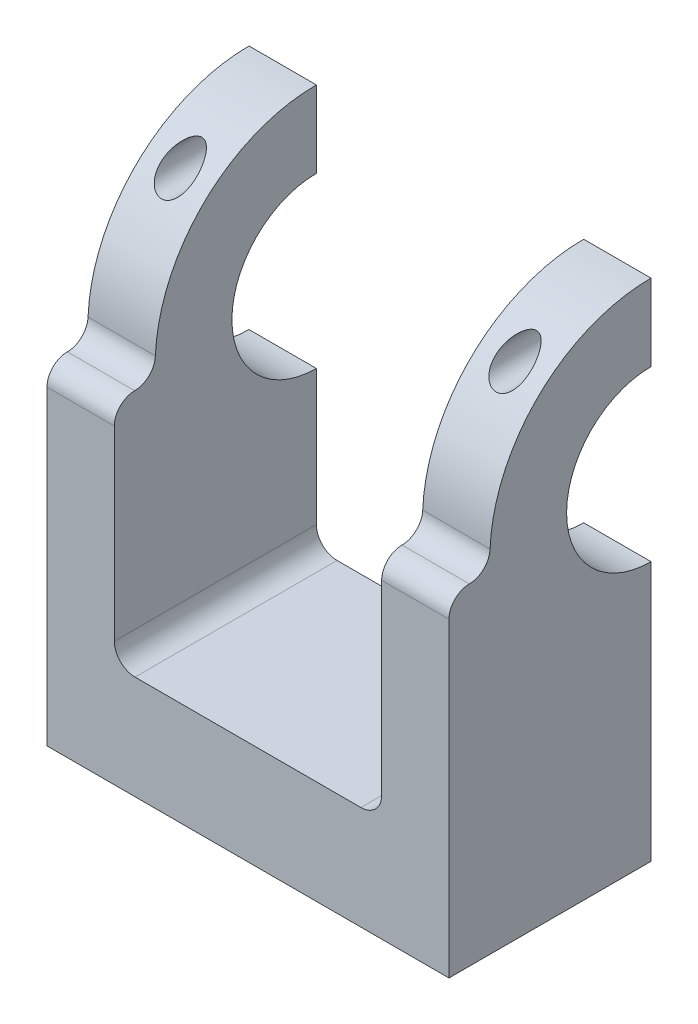
ISO-10303-21;
HEADER;
FILE_DESCRIPTION(('STEP AP214'),'2;1');
FILE_NAME('part.step','',(''),(''),'','','');
FILE_SCHEMA(('AUTOMOTIVE_DESIGN { 1 0 10303 214 1 1 1 1 }'));
ENDSEC;
DATA;
#1=APPLICATION_CONTEXT('core data for automotive mechanical design processes');
#2=APPLICATION_PROTOCOL_DEFINITION('international standard','automotive_design',2000,#1);
#3=PRODUCT_CONTEXT('',#1,'mechanical');
#4=PRODUCT('Part','Part','',(#3));
#5=PRODUCT_RELATED_PRODUCT_CATEGORY('part','',(#4));
#6=PRODUCT_DEFINITION_FORMATION('','',#4);
#7=PRODUCT_DEFINITION_CONTEXT('part definition',#1,'design');
#8=PRODUCT_DEFINITION('design','',#6,#7);
#9=PRODUCT_DEFINITION_SHAPE('','',#8);
#10=(LENGTH_UNIT() NAMED_UNIT(*) SI_UNIT(.MILLI.,.METRE.));
#11=(NAMED_UNIT(*) PLANE_ANGLE_UNIT() SI_UNIT($,.RADIAN.));
#12=(NAMED_UNIT(*) SI_UNIT($,.STERADIAN.) SOLID_ANGLE_UNIT());
#13=UNCERTAINTY_MEASURE_WITH_UNIT(LENGTH_MEASURE(1.E-05),#10,'distance_accuracy_value','');
#14=(GEOMETRIC_REPRESENTATION_CONTEXT(3) GLOBAL_UNCERTAINTY_ASSIGNED_CONTEXT((#13)) GLOBAL_UNIT_ASSIGNED_CONTEXT((#10,
#11,#12)) REPRESENTATION_CONTEXT('',''));
#15=CARTESIAN_POINT('',(0.,0.,0.));
#16=DIRECTION('',(0.,0.,1.));
#17=DIRECTION('',(1.,0.,0.));
#18=AXIS2_PLACEMENT_3D('',#15,#16,#17);
#19=CARTESIAN_POINT('',(38.8,0.,0.));
#20=DIRECTION('',(1.,0.,0.));
#21=DIRECTION('',(0.,0.,-1.));
#22=AXIS2_PLACEMENT_3D('',#19,#20,#21);
#23=PLANE('',#22);
#24=CARTESIAN_POINT('',(38.8,0.754006420562266,17.5337952057662));
#25=DIRECTION('',(1.,0.,0.));
#26=DIRECTION('',(0.,0.,-1.));
#27=AXIS2_PLACEMENT_3D('',#24,#25,#26);
#28=CIRCLE('',#27,2.);
#29=CARTESIAN_POINT('',(38.8,0.668079762948333,15.5356419059638));
#30=VERTEX_POINT('',#29);
#31=CARTESIAN_POINT('',(38.8,-1.24599357943773,17.5337952057662));
#32=VERTEX_POINT('',#31);
#33=EDGE_CURVE('E330',#30,#32,#28,.F.);
#34=ORIENTED_EDGE('',*,*,#33,.T.);
#35=CARTESIAN_POINT('',(38.8,-3.2121983736715,17.5337952057662));
#36=DIRECTION('',(1.,0.,0.));
#37=DIRECTION('',(0.,0.,-1.));
#38=AXIS2_PLACEMENT_3D('',#35,#36,#37);
#39=CIRCLE('',#38,1.96620479423377);
#40=CARTESIAN_POINT('',(38.8,-3.2121983736715,19.5));
#41=VERTEX_POINT('',#40);
#42=EDGE_CURVE('E236',#32,#41,#39,.T.);
#43=ORIENTED_EDGE('',*,*,#42,.T.);
#44=DIRECTION('',(0.,1.,0.));
#45=VECTOR('',#44,1.);
#46=CARTESIAN_POINT('',(38.8,-23.2,19.5));
#47=LINE('',#46,#45);
#48=CARTESIAN_POINT('',(38.8,-33.2,19.5));
#49=VERTEX_POINT('',#48);
#50=EDGE_CURVE('E246',#49,#41,#47,.T.);
#51=ORIENTED_EDGE('',*,*,#50,.F.);
#52=DIRECTION('',(0.,0.,-1.));
#53=VECTOR('',#52,1.);
#54=CARTESIAN_POINT('',(38.8,-33.2,19.5));
#55=LINE('',#54,#53);
#56=CARTESIAN_POINT('',(38.8,-33.2,0.));
#57=VERTEX_POINT('',#56);
#58=EDGE_CURVE('E205',#49,#57,#55,.T.);
#59=ORIENTED_EDGE('',*,*,#58,.T.);
#60=DIRECTION('',(0.,-1.,0.));
#61=VECTOR('',#60,1.);
#62=CARTESIAN_POINT('',(38.8,15.55,0.));
#63=LINE('',#62,#61);
#64=CARTESIAN_POINT('',(38.8,-8.15,0.));
#65=VERTEX_POINT('',#64);
#66=EDGE_CURVE('E455',#65,#57,#63,.T.);
#67=ORIENTED_EDGE('',*,*,#66,.F.);
#68=CARTESIAN_POINT('',(38.8,0.,0.));
#69=DIRECTION('',(1.,0.,0.));
#70=DIRECTION('',(0.,0.,-1.));
#71=AXIS2_PLACEMENT_3D('',#68,#69,#70);
#72=CIRCLE('',#71,8.15);
#73=CARTESIAN_POINT('',(38.8,8.15,0.));
#74=VERTEX_POINT('',#73);
#75=EDGE_CURVE('E445',#74,#65,#72,.T.);
#76=ORIENTED_EDGE('',*,*,#75,.F.);
#77=CARTESIAN_POINT('',(38.8,15.55,0.));
#78=VERTEX_POINT('',#77);
#79=EDGE_CURVE('E268',#78,#74,#63,.T.);
#80=ORIENTED_EDGE('',*,*,#79,.F.);
#81=CARTESIAN_POINT('',(38.8,0.,0.));
#82=DIRECTION('',(1.,0.,0.));
#83=DIRECTION('',(0.,0.,-1.));
#84=AXIS2_PLACEMENT_3D('',#81,#82,#83);
#85=CIRCLE('',#84,15.55);
#86=EDGE_CURVE('E424',#78,#30,#85,.T.);
#87=ORIENTED_EDGE('',*,*,#86,.T.);
#88=EDGE_LOOP('',(#34,#43,#51,#59,#67,#76,#80,#87));
#89=FACE_BOUND('',#88,.T.);
#90=ADVANCED_FACE('F47',(#89),#23,.T.);
#91=CARTESIAN_POINT('',(32.3,0.,0.));
#92=DIRECTION('',(1.,0.,0.));
#93=DIRECTION('',(0.,0.,-1.));
#94=AXIS2_PLACEMENT_3D('',#91,#92,#93);
#95=PLANE('',#94);
#96=DIRECTION('',(0.,1.,0.));
#97=VECTOR('',#96,1.);
#98=CARTESIAN_POINT('',(32.3,0.,0.));
#99=LINE('',#98,#97);
#100=CARTESIAN_POINT('',(32.3,-21.2,0.));
#101=VERTEX_POINT('',#100);
#102=CARTESIAN_POINT('',(32.3,-8.15,0.));
#103=VERTEX_POINT('',#102);
#104=EDGE_CURVE('E305',#101,#103,#99,.T.);
#105=ORIENTED_EDGE('',*,*,#104,.F.);
#106=DIRECTION('',(0.,0.,1.));
#107=VECTOR('',#106,1.);
#108=CARTESIAN_POINT('',(32.3,-21.2,0.));
#109=LINE('',#108,#107);
#110=CARTESIAN_POINT('',(32.3,-21.2,19.5));
#111=VERTEX_POINT('',#110);
#112=EDGE_CURVE('E308',#101,#111,#109,.T.);
#113=ORIENTED_EDGE('',*,*,#112,.T.);
#114=DIRECTION('',(0.,-1.,0.));
#115=VECTOR('',#114,1.);
#116=CARTESIAN_POINT('',(32.3,-1.24599357943773,19.5));
#117=LINE('',#116,#115);
#118=CARTESIAN_POINT('',(32.3,-3.2121983736715,19.5));
#119=VERTEX_POINT('',#118);
#120=EDGE_CURVE('E250',#119,#111,#117,.T.);
#121=ORIENTED_EDGE('',*,*,#120,.F.);
#122=CARTESIAN_POINT('',(32.3,-3.2121983736715,17.5337952057662));
#123=DIRECTION('',(1.,0.,0.));
#124=DIRECTION('',(0.,0.,-1.));
#125=AXIS2_PLACEMENT_3D('',#122,#123,#124);
#126=CIRCLE('',#125,1.96620479423377);
#127=CARTESIAN_POINT('',(32.3,-1.24599357943773,17.5337952057662));
#128=VERTEX_POINT('',#127);
#129=EDGE_CURVE('E243',#128,#119,#126,.T.);
#130=ORIENTED_EDGE('',*,*,#129,.F.);
#131=CARTESIAN_POINT('',(32.3,0.754006420562266,17.5337952057662));
#132=DIRECTION('',(1.,0.,0.));
#133=DIRECTION('',(0.,0.,-1.));
#134=AXIS2_PLACEMENT_3D('',#131,#132,#133);
#135=CIRCLE('',#134,2.);
#136=CARTESIAN_POINT('',(32.3,0.668079762948333,15.5356419059638));
#137=VERTEX_POINT('',#136);
#138=EDGE_CURVE('E324',#128,#137,#135,.T.);
#139=ORIENTED_EDGE('',*,*,#138,.T.);
#140=CARTESIAN_POINT('',(32.3,0.,0.));
#141=DIRECTION('',(1.,0.,0.));
#142=DIRECTION('',(0.,0.,-1.));
#143=AXIS2_PLACEMENT_3D('',#140,#141,#142);
#144=CIRCLE('',#143,15.55);
#145=CARTESIAN_POINT('',(32.3,15.55,0.));
#146=VERTEX_POINT('',#145);
#147=EDGE_CURVE('E441',#146,#137,#144,.T.);
#148=ORIENTED_EDGE('',*,*,#147,.F.);
#149=CARTESIAN_POINT('',(32.3,8.15,0.));
#150=VERTEX_POINT('',#149);
#151=EDGE_CURVE('E314',#150,#146,#99,.T.);
#152=ORIENTED_EDGE('',*,*,#151,.F.);
#153=CARTESIAN_POINT('',(32.3,0.,0.));
#154=DIRECTION('',(1.,0.,0.));
#155=DIRECTION('',(0.,0.,-1.));
#156=AXIS2_PLACEMENT_3D('',#153,#154,#155);
#157=CIRCLE('',#156,8.15);
#158=EDGE_CURVE('E311',#150,#103,#157,.T.);
#159=ORIENTED_EDGE('',*,*,#158,.T.);
#160=EDGE_LOOP('',(#105,#113,#121,#130,#139,#148,#152,#159));
#161=FACE_BOUND('',#160,.T.);
#162=ADVANCED_FACE('F293',(#161),#95,.F.);
#163=CARTESIAN_POINT('',(38.8,0.,0.));
#164=DIRECTION('',(-1.,0.,0.));
#165=DIRECTION('',(0.,0.,1.));
#166=AXIS2_PLACEMENT_3D('',#163,#164,#165);
#167=CYLINDRICAL_SURFACE('',#166,15.55);
#168=CARTESIAN_POINT('',(33.95,11.85,10.0687635785135));
#169=CARTESIAN_POINT('',(33.9500012225253,11.9215644775887,9.98453994667964));
#170=CARTESIAN_POINT('',(33.9547910498182,11.9922101877272,9.89957201127039));
#171=CARTESIAN_POINT('',(33.9733499867502,12.1312407756933,9.72870131097328));
#172=CARTESIAN_POINT('',(33.9871236739622,12.1996244822813,9.64279809148068));
#173=CARTESIAN_POINT('',(34.0233140750604,12.3338052468887,9.47056963300651));
#174=CARTESIAN_POINT('',(34.0457450321097,12.3995978443294,9.38424393124782));
#175=CARTESIAN_POINT('',(34.0991332613934,12.5281055808368,9.21198154484363));
#176=CARTESIAN_POINT('',(34.1300867174588,12.5908220825312,9.12604470354066));
#177=CARTESIAN_POINT('',(34.1900069436964,12.6942901102773,8.98124962825988));
#178=CARTESIAN_POINT('',(34.2167254878202,12.7359310553179,8.92208886192055));
#179=CARTESIAN_POINT('',(34.274587984937,12.8173780400416,8.80468169222602));
#180=CARTESIAN_POINT('',(34.3057309945392,12.8571844684927,8.74643509688247));
#181=CARTESIAN_POINT('',(34.3726604333643,12.9346596782492,8.63144669423295));
#182=CARTESIAN_POINT('',(34.4084350539096,12.9723335570977,8.5747014876113));
#183=CARTESIAN_POINT('',(34.4851123531695,13.0453305599229,8.46323130664284));
#184=CARTESIAN_POINT('',(34.5260120488672,13.0806550331949,8.40850518089474));
#185=CARTESIAN_POINT('',(34.6170934410609,13.1512581905055,8.29768389465131));
#186=CARTESIAN_POINT('',(34.6677568806179,13.1863051621385,8.24183201719599));
#187=CARTESIAN_POINT('',(34.7768488724667,13.2522473548452,8.13537595081262));
#188=CARTESIAN_POINT('',(34.8352727698058,13.2831450426127,8.08476864817691));
#189=CARTESIAN_POINT('',(34.9458826943474,13.3324893280661,8.00305809158511));
#190=CARTESIAN_POINT('',(34.9962031196593,13.3521447558813,7.97018829254928));
#191=CARTESIAN_POINT('',(35.1021792769695,13.3870594549479,7.91140350999026));
#192=CARTESIAN_POINT('',(35.1578241428763,13.4023274353647,7.88547475546777));
#193=CARTESIAN_POINT('',(35.2600996129927,13.4241676161055,7.84822136301359));
#194=CARTESIAN_POINT('',(35.3057320671588,13.4319438811107,7.83489074931042));
#195=CARTESIAN_POINT('',(35.3989311411787,13.443541725528,7.81497421637009));
#196=CARTESIAN_POINT('',(35.4464955680058,13.4473676654792,7.80838086034066));
#197=CARTESIAN_POINT('',(35.5424181008429,13.4507036037353,7.80263326472512));
#198=CARTESIAN_POINT('',(35.5907785165623,13.4501973407013,7.803507053767));
#199=CARTESIAN_POINT('',(35.6865559205709,13.4448852098124,7.81265555415488));
#200=CARTESIAN_POINT('',(35.7339722288589,13.4400763498932,7.82093541574892));
#201=CARTESIAN_POINT('',(35.8349222865249,13.42539506737,7.84611439482155));
#202=CARTESIAN_POINT('',(35.8880200233314,13.4147667479122,7.86429715522654));
#203=CARTESIAN_POINT('',(35.9900914862011,13.3891892002713,7.90776502846268));
#204=CARTESIAN_POINT('',(36.0390572897156,13.3742319044257,7.93306339974242));
#205=CARTESIAN_POINT('',(36.1578002530699,13.3320320561386,8.00386697923484));
#206=CARTESIAN_POINT('',(36.2246178932381,13.3025073269004,8.05292470299542));
#207=CARTESIAN_POINT('',(36.3489973065388,13.2379958538583,8.15854318401952));
#208=CARTESIAN_POINT('',(36.406534539868,13.2029950957667,8.21512313479387));
#209=CARTESIAN_POINT('',(36.5075790648004,13.1331095656052,8.32632931951027));
#210=CARTESIAN_POINT('',(36.551936016245,13.098651215009,8.38046412785407));
#211=CARTESIAN_POINT('',(36.6350936193192,13.0271079051105,8.49124919382796));
#212=CARTESIAN_POINT('',(36.6738901225917,12.9900210153043,8.54790128861973));
#213=CARTESIAN_POINT('',(36.746508193994,12.9135559982794,8.66298764611263));
#214=CARTESIAN_POINT('',(36.7803207870012,12.8741739115093,8.72142490059167));
#215=CARTESIAN_POINT('',(36.8432750878646,12.7934296717941,8.83944427761012));
#216=CARTESIAN_POINT('',(36.8724155660237,12.7520670012688,8.89902669695009));
#217=CARTESIAN_POINT('',(36.9380582918188,12.6490547391351,9.04516559061454));
#218=CARTESIAN_POINT('',(36.9722010663349,12.5864489541005,9.13211519018578));
#219=CARTESIAN_POINT('',(37.0316871561499,12.4579591654763,9.30663807445581));
#220=CARTESIAN_POINT('',(37.0570263793739,12.3920736536249,9.39421162993374));
#221=CARTESIAN_POINT('',(37.098858136265,12.2574366564073,9.56921742403365));
#222=CARTESIAN_POINT('',(37.1153546241774,12.1886864668995,9.65664970836082));
#223=CARTESIAN_POINT('',(37.1391949637156,12.0487304110793,9.83072115259907));
#224=CARTESIAN_POINT('',(37.1465424466346,11.9775255305878,9.91736061362392));
#225=CARTESIAN_POINT('',(37.1529075401639,11.7937552561532,10.1360651812451));
#226=CARTESIAN_POINT('',(37.1452214135325,11.6797571903004,10.2672083792395));
#227=CARTESIAN_POINT('',(37.1034935444119,11.4496341669388,10.5232042193498));
#228=CARTESIAN_POINT('',(37.0695044936598,11.3335139142883,10.6480689070259));
#229=CARTESIAN_POINT('',(36.985581229867,11.1381216417741,10.8516517818667));
#230=CARTESIAN_POINT('',(36.9434727723324,11.0582308110025,10.9329893844243));
#231=CARTESIAN_POINT('',(36.8423946013468,10.9021955349043,11.0885835591425));
#232=CARTESIAN_POINT('',(36.7834463715604,10.8260464601162,11.1628489938134));
#233=CARTESIAN_POINT('',(36.6631412718756,10.6981637341553,11.2852888523119));
#234=CARTESIAN_POINT('',(36.6055397061966,10.6448730703492,11.3355124358871));
#235=CARTESIAN_POINT('',(36.4793377172497,10.5450947253015,11.4283902362239));
#236=CARTESIAN_POINT('',(36.4107514296082,10.4985984458551,11.4710540345972));
#237=CARTESIAN_POINT('',(36.276512471407,10.4227639670271,11.5399583383839));
#238=CARTESIAN_POINT('',(36.2125678626135,10.3918435438933,11.5677733915041));
#239=CARTESIAN_POINT('',(36.0786442984448,10.3381373321087,11.6157960679049));
#240=CARTESIAN_POINT('',(36.0086681305404,10.3153478105424,11.636007182404));
#241=CARTESIAN_POINT('',(35.86392927369,10.2793191333336,11.667848584814));
#242=CARTESIAN_POINT('',(35.7891409936362,10.2661365894411,11.6794280171696));
#243=CARTESIAN_POINT('',(35.6375953652042,10.2505878398313,11.6930775970464));
#244=CARTESIAN_POINT('',(35.5608388858363,10.2482169404581,11.6951518710409));
#245=CARTESIAN_POINT('',(35.4158183642081,10.2541522012073,11.6899472703439));
#246=CARTESIAN_POINT('',(35.3474740125365,10.2614123317948,11.6835847484342));
#247=CARTESIAN_POINT('',(35.2133653772756,10.2843356433097,11.6634116357526));
#248=CARTESIAN_POINT('',(35.1476009996647,10.299998517711,11.649601316671));
#249=CARTESIAN_POINT('',(35.0194867390607,10.339008935751,11.6149934839572));
#250=CARTESIAN_POINT('',(34.9571846335783,10.3624425042391,11.5941176966285));
#251=CARTESIAN_POINT('',(34.8379047596766,10.4157073429141,11.5462904443819));
#252=CARTESIAN_POINT('',(34.7809294253313,10.4455415175479,11.5193362209254));
#253=CARTESIAN_POINT('',(34.6514191983157,10.5232386063068,11.4484792498744));
#254=CARTESIAN_POINT('',(34.58170411812,10.5735535223604,11.4020987430205));
#255=CARTESIAN_POINT('',(34.4542953295906,10.6810626965338,11.301453611262));
#256=CARTESIAN_POINT('',(34.3966261482973,10.7382706235895,11.2471732750879));
#257=CARTESIAN_POINT('',(34.274363905549,10.8782927911854,11.1120534782358));
#258=CARTESIAN_POINT('',(34.2146966989135,10.9629360628724,11.0286674717643));
#259=CARTESIAN_POINT('',(34.1148569327634,11.1356186607368,10.8542911787521));
#260=CARTESIAN_POINT('',(34.0747053549166,11.2236615326445,10.7632928306344));
#261=CARTESIAN_POINT('',(34.0108980870918,11.4023653653201,10.5738324839224));
#262=CARTESIAN_POINT('',(33.9876632207512,11.4930382900552,10.4752434720672));
#263=CARTESIAN_POINT('',(33.9572113742946,11.6729357908181,10.2743985704762));
#264=CARTESIAN_POINT('',(33.9499984994422,11.7621599898313,10.1721417477674));
#265=CARTESIAN_POINT('',(33.95,11.85,10.0687635785135));
#266=B_SPLINE_CURVE_WITH_KNOTS('',3,(#168,#169,#170,#171,#172,#173,#174,#175,#176,#177,#178,
#179,#180,#181,#182,#183,#184,#185,#186,#187,#188,#189,#190,#191,#192,#193,#194,#195,#196,#197,
#198,#199,#200,#201,#202,#203,#204,#205,#206,#207,#208,#209,#210,#211,#212,#213,#214,#215,#216,
#217,#218,#219,#220,#221,#222,#223,#224,#225,#226,#227,#228,#229,#230,#231,#232,#233,#234,#235,
#236,#237,#238,#239,#240,#241,#242,#243,#244,#245,#246,#247,#248,#249,#250,#251,#252,#253,#254,
#255,#256,#257,#258,#259,#260,#261,#262,#263,#264,#265),.UNSPECIFIED.,.T.,.F.,(4,2,2,2,2,2,2,2,
2,2,2,2,2,2,2,2,2,2,2,2,2,2,2,2,2,2,2,2,2,2,2,2,2,2,2,2,2,2,2,2,2,2,2,2,2,2,2,2,4),(0.,
0.33142399845103,0.663017000425858,0.995157889412732,1.3271502949389,1.55838314896632,
1.7895667729943,2.02017217375603,2.25064397020438,2.4996331328989,2.74847361332128,
2.93762121082297,3.12639071140163,3.2703239986346,3.41409823568645,3.55841237915848,
3.70282695804654,3.87324754407706,4.0439878010265,4.30649610172351,4.56968754892157,
4.80338920840379,5.03726432279027,5.27155558920561,5.505908420035,5.84282391438361,
6.17989580524212,6.51681684015815,6.85360410648772,7.37356035831772,7.89247768763019,
8.25595993774942,8.61898052357767,8.89749205746568,9.17564802826523,9.40355835954681,
9.63136392162269,9.86050126895598,10.0895391314865,10.2956275775955,10.5017085062571,
10.7101515603773,10.9186894019522,11.2101370087615,11.50217237803,11.8988709734203,
12.2959951296666,12.702688950354,13.1094869648858),.UNSPECIFIED.);
#267=CARTESIAN_POINT('',(33.95,11.85,10.0687635785135));
#268=VERTEX_POINT('',#267);
#269=EDGE_CURVE('E258',#268,#268,#266,.T.);
#270=ORIENTED_EDGE('',*,*,#269,.T.);
#271=EDGE_LOOP('',(#270));
#272=FACE_BOUND('',#271,.T.);
#273=ORIENTED_EDGE('',*,*,#147,.T.);
#274=DIRECTION('',(-1.,0.,0.));
#275=VECTOR('',#274,1.);
#276=CARTESIAN_POINT('',(38.8,0.668079762948333,15.5356419059638));
#277=LINE('',#276,#275);
#278=EDGE_CURVE('E429',#137,#30,#277,.F.);
#279=ORIENTED_EDGE('',*,*,#278,.T.);
#280=ORIENTED_EDGE('',*,*,#86,.F.);
#281=DIRECTION('',(-1.,0.,0.));
#282=VECTOR('',#281,1.);
#283=CARTESIAN_POINT('',(73.5708570501217,15.55,0.));
#284=LINE('',#283,#282);
#285=EDGE_CURVE('E267',#78,#146,#284,.T.);
#286=ORIENTED_EDGE('',*,*,#285,.T.);
#287=EDGE_LOOP('',(#273,#279,#280,#286));
#288=FACE_BOUND('',#287,.T.);
#289=ADVANCED_FACE('F270',(#272,#288),#167,.T.);
#290=CARTESIAN_POINT('',(38.8,0.,0.));
#291=DIRECTION('',(-1.,0.,0.));
#292=DIRECTION('',(0.,0.,1.));
#293=AXIS2_PLACEMENT_3D('',#290,#291,#292);
#294=CYLINDRICAL_SURFACE('',#293,8.15);
#295=ORIENTED_EDGE('',*,*,#75,.T.);
#296=DIRECTION('',(-1.,0.,0.));
#297=VECTOR('',#296,1.);
#298=CARTESIAN_POINT('',(38.8,-8.15,0.));
#299=LINE('',#298,#297);
#300=EDGE_CURVE('E432',#65,#103,#299,.T.);
#301=ORIENTED_EDGE('',*,*,#300,.T.);
#302=ORIENTED_EDGE('',*,*,#158,.F.);
#303=DIRECTION('',(-1.,0.,0.));
#304=VECTOR('',#303,1.);
#305=CARTESIAN_POINT('',(38.8,8.15,0.));
#306=LINE('',#305,#304);
#307=EDGE_CURVE('E437',#150,#74,#306,.F.);
#308=ORIENTED_EDGE('',*,*,#307,.T.);
#309=EDGE_LOOP('',(#295,#301,#302,#308));
#310=FACE_BOUND('',#309,.T.);
#311=ADVANCED_FACE('F288',(#310),#294,.F.);
#312=CARTESIAN_POINT('',(73.5708570501217,15.55,0.));
#313=DIRECTION('',(0.,0.,-1.));
#314=DIRECTION('',(-1.,0.,0.));
#315=AXIS2_PLACEMENT_3D('',#312,#313,#314);
#316=PLANE('',#315);
#317=CARTESIAN_POINT('',(35.55,11.85,0.));
#318=DIRECTION('',(0.,0.,-1.));
#319=DIRECTION('',(-1.,0.,0.));
#320=AXIS2_PLACEMENT_3D('',#317,#318,#319);
#321=CIRCLE('',#320,1.6);
#322=CARTESIAN_POINT('',(33.95,11.85,0.));
#323=VERTEX_POINT('',#322);
#324=EDGE_CURVE('E254',#323,#323,#321,.T.);
#325=ORIENTED_EDGE('',*,*,#324,.F.);
#326=EDGE_LOOP('',(#325));
#327=FACE_BOUND('',#326,.T.);
#328=ORIENTED_EDGE('',*,*,#151,.T.);
#329=ORIENTED_EDGE('',*,*,#285,.F.);
#330=ORIENTED_EDGE('',*,*,#79,.T.);
#331=ORIENTED_EDGE('',*,*,#307,.F.);
#332=EDGE_LOOP('',(#328,#329,#330,#331));
#333=FACE_BOUND('',#332,.T.);
#334=ADVANCED_FACE('F285',(#327,#333),#316,.T.);
#335=DIRECTION('',(1.,0.,0.));
#336=VECTOR('',#335,1.);
#337=CARTESIAN_POINT('',(-21.9146070008111,-23.2,0.));
#338=LINE('',#337,#336);
#339=CARTESIAN_POINT('',(8.5,-23.2,0.));
#340=VERTEX_POINT('',#339);
#341=CARTESIAN_POINT('',(30.3,-23.2,0.));
#342=VERTEX_POINT('',#341);
#343=EDGE_CURVE('E223',#340,#342,#338,.T.);
#344=ORIENTED_EDGE('',*,*,#343,.T.);
#345=CARTESIAN_POINT('',(30.3,-21.2,0.));
#346=DIRECTION('',(0.,0.,-1.));
#347=DIRECTION('',(-1.,0.,0.));
#348=AXIS2_PLACEMENT_3D('',#345,#346,#347);
#349=CIRCLE('',#348,2.);
#350=EDGE_CURVE('E320',#342,#101,#349,.F.);
#351=ORIENTED_EDGE('',*,*,#350,.T.);
#352=ORIENTED_EDGE('',*,*,#104,.T.);
#353=ORIENTED_EDGE('',*,*,#300,.F.);
#354=ORIENTED_EDGE('',*,*,#66,.T.);
#355=DIRECTION('',(1.,0.,0.));
#356=VECTOR('',#355,1.);
#357=CARTESIAN_POINT('',(-21.9146070008111,-33.2,0.));
#358=LINE('',#357,#356);
#359=CARTESIAN_POINT('',(0.,-33.2,0.));
#360=VERTEX_POINT('',#359);
#361=EDGE_CURVE('E227',#360,#57,#358,.T.);
#362=ORIENTED_EDGE('',*,*,#361,.F.);
#363=DIRECTION('',(0.,-1.,0.));
#364=VECTOR('',#363,1.);
#365=CARTESIAN_POINT('',(0.,-33.2,0.));
#366=LINE('',#365,#364);
#367=CARTESIAN_POINT('',(0.,-8.15,0.));
#368=VERTEX_POINT('',#367);
#369=EDGE_CURVE('E209',#368,#360,#366,.T.);
#370=ORIENTED_EDGE('',*,*,#369,.F.);
#371=DIRECTION('',(-1.,0.,0.));
#372=VECTOR('',#371,1.);
#373=CARTESIAN_POINT('',(6.5,-8.15,0.));
#374=LINE('',#373,#372);
#375=CARTESIAN_POINT('',(6.5,-8.15,0.));
#376=VERTEX_POINT('',#375);
#377=EDGE_CURVE('E186',#376,#368,#374,.T.);
#378=ORIENTED_EDGE('',*,*,#377,.F.);
#379=DIRECTION('',(0.,1.,0.));
#380=VECTOR('',#379,1.);
#381=CARTESIAN_POINT('',(6.5,0.,0.));
#382=LINE('',#381,#380);
#383=CARTESIAN_POINT('',(6.5,-21.2,0.));
#384=VERTEX_POINT('',#383);
#385=EDGE_CURVE('E346',#384,#376,#382,.T.);
#386=ORIENTED_EDGE('',*,*,#385,.F.);
#387=CARTESIAN_POINT('',(8.5,-21.2,0.));
#388=DIRECTION('',(0.,0.,-1.));
#389=DIRECTION('',(-1.,0.,0.));
#390=AXIS2_PLACEMENT_3D('',#387,#388,#389);
#391=CIRCLE('',#390,2.);
#392=EDGE_CURVE('E56',#384,#340,#391,.F.);
#393=ORIENTED_EDGE('',*,*,#392,.T.);
#394=EDGE_LOOP('',(#344,#351,#352,#353,#354,#362,#370,#378,#386,#393));
#395=FACE_BOUND('',#394,.T.);
#396=ADVANCED_FACE('F280',(#395),#316,.T.);
#397=CARTESIAN_POINT('',(35.55,11.85,15.55));
#398=DIRECTION('',(0.,0.,-1.));
#399=DIRECTION('',(-1.,0.,0.));
#400=AXIS2_PLACEMENT_3D('',#397,#398,#399);
#401=CYLINDRICAL_SURFACE('',#400,1.6);
#402=ORIENTED_EDGE('',*,*,#324,.T.);
#403=EDGE_LOOP('',(#402));
#404=FACE_BOUND('',#403,.T.);
#405=ORIENTED_EDGE('',*,*,#269,.F.);
#406=EDGE_LOOP('',(#405));
#407=FACE_BOUND('',#406,.T.);
#408=ADVANCED_FACE('F274',(#404,#407),#401,.F.);
#409=CARTESIAN_POINT('',(0.,0.,19.5));
#410=DIRECTION('',(0.,0.,1.));
#411=DIRECTION('',(1.,0.,0.));
#412=AXIS2_PLACEMENT_3D('',#409,#410,#411);
#413=PLANE('',#412);
#414=DIRECTION('',(1.,0.,0.));
#415=VECTOR('',#414,1.);
#416=CARTESIAN_POINT('',(0.,-3.2121983736715,19.5));
#417=LINE('',#416,#415);
#418=EDGE_CURVE('E240',#119,#41,#417,.T.);
#419=ORIENTED_EDGE('',*,*,#418,.F.);
#420=ORIENTED_EDGE('',*,*,#120,.T.);
#421=CARTESIAN_POINT('',(30.3,-21.2,19.5));
#422=DIRECTION('',(0.,0.,1.));
#423=DIRECTION('',(1.,0.,0.));
#424=AXIS2_PLACEMENT_3D('',#421,#422,#423);
#425=CIRCLE('',#424,2.);
#426=CARTESIAN_POINT('',(30.3,-23.2,19.5));
#427=VERTEX_POINT('',#426);
#428=EDGE_CURVE('E321',#111,#427,#425,.F.);
#429=ORIENTED_EDGE('',*,*,#428,.T.);
#430=DIRECTION('',(1.,0.,0.));
#431=VECTOR('',#430,1.);
#432=CARTESIAN_POINT('',(-21.9146070008111,-23.2,19.5));
#433=LINE('',#432,#431);
#434=CARTESIAN_POINT('',(8.5,-23.2,19.5));
#435=VERTEX_POINT('',#434);
#436=EDGE_CURVE('E212',#435,#427,#433,.T.);
#437=ORIENTED_EDGE('',*,*,#436,.F.);
#438=CARTESIAN_POINT('',(8.5,-21.2,19.5));
#439=DIRECTION('',(0.,0.,1.));
#440=DIRECTION('',(1.,0.,0.));
#441=AXIS2_PLACEMENT_3D('',#438,#439,#440);
#442=CIRCLE('',#441,2.);
#443=CARTESIAN_POINT('',(6.5,-21.2,19.5));
#444=VERTEX_POINT('',#443);
#445=EDGE_CURVE('E11',#435,#444,#442,.F.);
#446=ORIENTED_EDGE('',*,*,#445,.T.);
#447=DIRECTION('',(0.,1.,0.));
#448=VECTOR('',#447,1.);
#449=CARTESIAN_POINT('',(6.5,-23.2,19.5));
#450=LINE('',#449,#448);
#451=CARTESIAN_POINT('',(6.5,-3.2121983736715,19.5));
#452=VERTEX_POINT('',#451);
#453=EDGE_CURVE('E352',#444,#452,#450,.T.);
#454=ORIENTED_EDGE('',*,*,#453,.T.);
#455=DIRECTION('',(1.,0.,0.));
#456=VECTOR('',#455,1.);
#457=CARTESIAN_POINT('',(0.,-3.2121983736715,19.5));
#458=LINE('',#457,#456);
#459=CARTESIAN_POINT('',(0.,-3.2121983736715,19.5));
#460=VERTEX_POINT('',#459);
#461=EDGE_CURVE('E196',#460,#452,#458,.T.);
#462=ORIENTED_EDGE('',*,*,#461,.F.);
#463=DIRECTION('',(0.,1.,0.));
#464=VECTOR('',#463,1.);
#465=CARTESIAN_POINT('',(0.,-23.2,19.5));
#466=LINE('',#465,#464);
#467=CARTESIAN_POINT('',(0.,-33.2,19.5));
#468=VERTEX_POINT('',#467);
#469=EDGE_CURVE('E194',#468,#460,#466,.T.);
#470=ORIENTED_EDGE('',*,*,#469,.F.);
#471=DIRECTION('',(1.,0.,0.));
#472=VECTOR('',#471,1.);
#473=CARTESIAN_POINT('',(-21.9146070008111,-33.2,19.5));
#474=LINE('',#473,#472);
#475=EDGE_CURVE('E219',#468,#49,#474,.T.);
#476=ORIENTED_EDGE('',*,*,#475,.T.);
#477=ORIENTED_EDGE('',*,*,#50,.T.);
#478=EDGE_LOOP('',(#419,#420,#429,#437,#446,#454,#462,#470,#476,#477));
#479=FACE_BOUND('',#478,.T.);
#480=ADVANCED_FACE('F279',(#479),#413,.T.);
#481=CARTESIAN_POINT('',(38.8,0.754006420562266,17.5337952057662));
#482=DIRECTION('',(-1.,0.,0.));
#483=DIRECTION('',(0.,0.,1.));
#484=AXIS2_PLACEMENT_3D('',#481,#482,#483);
#485=CYLINDRICAL_SURFACE('',#484,2.);
#486=ORIENTED_EDGE('',*,*,#138,.F.);
#487=DIRECTION('',(1.,0.,0.));
#488=VECTOR('',#487,1.);
#489=CARTESIAN_POINT('',(32.3,-1.24599357943773,17.5337952057662));
#490=LINE('',#489,#488);
#491=EDGE_CURVE('E415',#32,#128,#490,.F.);
#492=ORIENTED_EDGE('',*,*,#491,.F.);
#493=ORIENTED_EDGE('',*,*,#33,.F.);
#494=ORIENTED_EDGE('',*,*,#278,.F.);
#495=EDGE_LOOP('',(#486,#492,#493,#494));
#496=FACE_BOUND('',#495,.T.);
#497=ADVANCED_FACE('F406',(#496),#485,.F.);
#498=CARTESIAN_POINT('',(0.,-3.2121983736715,17.5337952057662));
#499=DIRECTION('',(1.,0.,0.));
#500=DIRECTION('',(0.,0.,-1.));
#501=AXIS2_PLACEMENT_3D('',#498,#499,#500);
#502=CYLINDRICAL_SURFACE('',#501,1.96620479423377);
#503=ORIENTED_EDGE('',*,*,#129,.T.);
#504=ORIENTED_EDGE('',*,*,#418,.T.);
#505=ORIENTED_EDGE('',*,*,#42,.F.);
#506=ORIENTED_EDGE('',*,*,#491,.T.);
#507=EDGE_LOOP('',(#503,#504,#505,#506));
#508=FACE_BOUND('',#507,.T.);
#509=ADVANCED_FACE('F404',(#508),#502,.T.);
#510=CARTESIAN_POINT('',(-21.9146070008111,-23.2,19.5));
#511=DIRECTION('',(0.,1.,0.));
#512=DIRECTION('',(0.,0.,1.));
#513=AXIS2_PLACEMENT_3D('',#510,#511,#512);
#514=PLANE('',#513);
#515=ORIENTED_EDGE('',*,*,#436,.T.);
#516=DIRECTION('',(0.,0.,1.));
#517=VECTOR('',#516,1.);
#518=CARTESIAN_POINT('',(30.3,-23.2,19.5));
#519=LINE('',#518,#517);
#520=EDGE_CURVE('E328',#427,#342,#519,.F.);
#521=ORIENTED_EDGE('',*,*,#520,.T.);
#522=ORIENTED_EDGE('',*,*,#343,.F.);
#523=DIRECTION('',(0.,0.,-1.));
#524=VECTOR('',#523,1.);
#525=CARTESIAN_POINT('',(8.5,-23.2,19.5));
#526=LINE('',#525,#524);
#527=EDGE_CURVE('E323',#340,#435,#526,.F.);
#528=ORIENTED_EDGE('',*,*,#527,.T.);
#529=EDGE_LOOP('',(#515,#521,#522,#528));
#530=FACE_BOUND('',#529,.T.);
#531=ADVANCED_FACE('F348',(#530),#514,.T.);
#532=CARTESIAN_POINT('',(-21.9146070008111,-33.2,19.5));
#533=DIRECTION('',(0.,-1.,0.));
#534=DIRECTION('',(0.,0.,-1.));
#535=AXIS2_PLACEMENT_3D('',#532,#533,#534);
#536=PLANE('',#535);
#537=DIRECTION('',(0.,0.,1.));
#538=VECTOR('',#537,1.);
#539=CARTESIAN_POINT('',(0.,-33.2,19.5));
#540=LINE('',#539,#538);
#541=EDGE_CURVE('E215',#360,#468,#540,.T.);
#542=ORIENTED_EDGE('',*,*,#541,.F.);
#543=ORIENTED_EDGE('',*,*,#361,.T.);
#544=ORIENTED_EDGE('',*,*,#58,.F.);
#545=ORIENTED_EDGE('',*,*,#475,.F.);
#546=EDGE_LOOP('',(#542,#543,#544,#545));
#547=FACE_BOUND('',#546,.T.);
#548=ADVANCED_FACE('F396',(#547),#536,.T.);
#549=CARTESIAN_POINT('',(0.,0.,0.));
#550=DIRECTION('',(1.,0.,0.));
#551=DIRECTION('',(0.,0.,-1.));
#552=AXIS2_PLACEMENT_3D('',#549,#550,#551);
#553=PLANE('',#552);
#554=ORIENTED_EDGE('',*,*,#469,.T.);
#555=CARTESIAN_POINT('',(0.,-3.2121983736715,17.5337952057662));
#556=DIRECTION('',(1.,0.,0.));
#557=DIRECTION('',(0.,0.,-1.));
#558=AXIS2_PLACEMENT_3D('',#555,#556,#557);
#559=CIRCLE('',#558,1.96620479423377);
#560=CARTESIAN_POINT('',(0.,-1.24599357943773,17.5337952057662));
#561=VERTEX_POINT('',#560);
#562=EDGE_CURVE('E176',#561,#460,#559,.T.);
#563=ORIENTED_EDGE('',*,*,#562,.F.);
#564=CARTESIAN_POINT('',(0.,0.754006420562266,17.5337952057662));
#565=DIRECTION('',(1.,0.,0.));
#566=DIRECTION('',(0.,0.,-1.));
#567=AXIS2_PLACEMENT_3D('',#564,#565,#566);
#568=CIRCLE('',#567,2.);
#569=CARTESIAN_POINT('',(0.,0.668079762948333,15.5356419059638));
#570=VERTEX_POINT('',#569);
#571=EDGE_CURVE('E191',#561,#570,#568,.T.);
#572=ORIENTED_EDGE('',*,*,#571,.T.);
#573=CARTESIAN_POINT('',(0.,0.,0.));
#574=DIRECTION('',(1.,0.,0.));
#575=DIRECTION('',(0.,0.,-1.));
#576=AXIS2_PLACEMENT_3D('',#573,#574,#575);
#577=CIRCLE('',#576,15.55);
#578=CARTESIAN_POINT('',(0.,15.55,0.));
#579=VERTEX_POINT('',#578);
#580=EDGE_CURVE('E487',#579,#570,#577,.T.);
#581=ORIENTED_EDGE('',*,*,#580,.F.);
#582=DIRECTION('',(0.,-1.,0.));
#583=VECTOR('',#582,1.);
#584=CARTESIAN_POINT('',(0.,15.55,0.));
#585=LINE('',#584,#583);
#586=CARTESIAN_POINT('',(0.,8.15,0.));
#587=VERTEX_POINT('',#586);
#588=EDGE_CURVE('E373',#579,#587,#585,.T.);
#589=ORIENTED_EDGE('',*,*,#588,.T.);
#590=CARTESIAN_POINT('',(0.,0.,0.));
#591=DIRECTION('',(1.,0.,0.));
#592=DIRECTION('',(0.,0.,-1.));
#593=AXIS2_PLACEMENT_3D('',#590,#591,#592);
#594=CIRCLE('',#593,8.15);
#595=EDGE_CURVE('E486',#587,#368,#594,.T.);
#596=ORIENTED_EDGE('',*,*,#595,.T.);
#597=ORIENTED_EDGE('',*,*,#369,.T.);
#598=ORIENTED_EDGE('',*,*,#541,.T.);
#599=EDGE_LOOP('',(#554,#563,#572,#581,#589,#596,#597,#598));
#600=FACE_BOUND('',#599,.T.);
#601=ADVANCED_FACE('F189',(#600),#553,.F.);
#602=CARTESIAN_POINT('',(6.5,0.,0.));
#603=DIRECTION('',(1.,0.,0.));
#604=DIRECTION('',(0.,0.,-1.));
#605=AXIS2_PLACEMENT_3D('',#602,#603,#604);
#606=PLANE('',#605);
#607=ORIENTED_EDGE('',*,*,#453,.F.);
#608=DIRECTION('',(0.,0.,-1.));
#609=VECTOR('',#608,1.);
#610=CARTESIAN_POINT('',(6.5,-21.2,0.));
#611=LINE('',#610,#609);
#612=EDGE_CURVE('E336',#444,#384,#611,.T.);
#613=ORIENTED_EDGE('',*,*,#612,.T.);
#614=ORIENTED_EDGE('',*,*,#385,.T.);
#615=CARTESIAN_POINT('',(6.5,0.,0.));
#616=DIRECTION('',(1.,0.,0.));
#617=DIRECTION('',(0.,0.,-1.));
#618=AXIS2_PLACEMENT_3D('',#615,#616,#617);
#619=CIRCLE('',#618,8.15);
#620=CARTESIAN_POINT('',(6.5,8.15,0.));
#621=VERTEX_POINT('',#620);
#622=EDGE_CURVE('E491',#621,#376,#619,.T.);
#623=ORIENTED_EDGE('',*,*,#622,.F.);
#624=CARTESIAN_POINT('',(6.50000000000001,15.55,0.));
#625=VERTEX_POINT('',#624);
#626=EDGE_CURVE('E479',#621,#625,#382,.T.);
#627=ORIENTED_EDGE('',*,*,#626,.T.);
#628=CARTESIAN_POINT('',(6.5,0.,0.));
#629=DIRECTION('',(1.,0.,0.));
#630=DIRECTION('',(0.,0.,-1.));
#631=AXIS2_PLACEMENT_3D('',#628,#629,#630);
#632=CIRCLE('',#631,15.55);
#633=CARTESIAN_POINT('',(6.5,0.668079762948333,15.5356419059638));
#634=VERTEX_POINT('',#633);
#635=EDGE_CURVE('E483',#625,#634,#632,.T.);
#636=ORIENTED_EDGE('',*,*,#635,.T.);
#637=CARTESIAN_POINT('',(6.5,0.754006420562266,17.5337952057662));
#638=DIRECTION('',(1.,0.,0.));
#639=DIRECTION('',(0.,0.,-1.));
#640=AXIS2_PLACEMENT_3D('',#637,#638,#639);
#641=CIRCLE('',#640,2.);
#642=CARTESIAN_POINT('',(6.5,-1.24599357943773,17.5337952057662));
#643=VERTEX_POINT('',#642);
#644=EDGE_CURVE('E201',#634,#643,#641,.F.);
#645=ORIENTED_EDGE('',*,*,#644,.T.);
#646=CARTESIAN_POINT('',(6.5,-3.2121983736715,17.5337952057662));
#647=DIRECTION('',(1.,0.,0.));
#648=DIRECTION('',(0.,0.,-1.));
#649=AXIS2_PLACEMENT_3D('',#646,#647,#648);
#650=CIRCLE('',#649,1.96620479423377);
#651=EDGE_CURVE('E179',#643,#452,#650,.T.);
#652=ORIENTED_EDGE('',*,*,#651,.T.);
#653=EDGE_LOOP('',(#607,#613,#614,#623,#627,#636,#645,#652));
#654=FACE_BOUND('',#653,.T.);
#655=ADVANCED_FACE('F350',(#654),#606,.T.);
#656=CARTESIAN_POINT('',(6.5,0.,0.));
#657=DIRECTION('',(-1.,0.,0.));
#658=DIRECTION('',(0.,0.,1.));
#659=AXIS2_PLACEMENT_3D('',#656,#657,#658);
#660=CYLINDRICAL_SURFACE('',#659,15.55);
#661=CARTESIAN_POINT('',(1.65,11.85,10.0687635785135));
#662=CARTESIAN_POINT('',(1.65000122252527,11.9215644775887,9.98453994667964));
#663=CARTESIAN_POINT('',(1.65479104981825,11.9922101877272,9.89957201127039));
#664=CARTESIAN_POINT('',(1.67334998675016,12.1312407756933,9.72870131097329));
#665=CARTESIAN_POINT('',(1.68712367396216,12.1996244822813,9.64279809148069));
#666=CARTESIAN_POINT('',(1.72331407506043,12.3338052468887,9.47056963300651));
#667=CARTESIAN_POINT('',(1.74574503210975,12.3995978443294,9.38424393124782));
#668=CARTESIAN_POINT('',(1.7991332613934,12.5281055808367,9.21198154484363));
#669=CARTESIAN_POINT('',(1.8300867174588,12.5908220825312,9.12604470354066));
#670=CARTESIAN_POINT('',(1.89000694369642,12.6942901102773,8.98124962825988));
#671=CARTESIAN_POINT('',(1.91672548782022,12.7359310553179,8.92208886192055));
#672=CARTESIAN_POINT('',(1.97458798493698,12.8173780400416,8.80468169222602));
#673=CARTESIAN_POINT('',(2.00573099453925,12.8571844684927,8.74643509688247));
#674=CARTESIAN_POINT('',(2.07266043336434,12.9346596782492,8.63144669423295));
#675=CARTESIAN_POINT('',(2.10843505390961,12.9723335570977,8.5747014876113));
#676=CARTESIAN_POINT('',(2.18511235316955,13.0453305599229,8.46323130664284));
#677=CARTESIAN_POINT('',(2.22601204886718,13.0806550331949,8.40850518089473));
#678=CARTESIAN_POINT('',(2.31709344106092,13.1512581905055,8.2976838946513));
#679=CARTESIAN_POINT('',(2.36775688061795,13.1863051621385,8.24183201719599));
#680=CARTESIAN_POINT('',(2.47684887246668,13.2522473548452,8.13537595081262));
#681=CARTESIAN_POINT('',(2.53527276980582,13.2831450426127,8.08476864817691));
#682=CARTESIAN_POINT('',(2.64588269434736,13.3324893280661,8.00305809158511));
#683=CARTESIAN_POINT('',(2.69620311965933,13.3521447558813,7.97018829254928));
#684=CARTESIAN_POINT('',(2.80217927696951,13.3870594549479,7.91140350999026));
#685=CARTESIAN_POINT('',(2.85782414287626,13.4023274353647,7.88547475546777));
#686=CARTESIAN_POINT('',(2.96009961299275,13.4241676161055,7.84822136301358));
#687=CARTESIAN_POINT('',(3.00573206715882,13.4319438811108,7.83489074931041));
#688=CARTESIAN_POINT('',(3.09893114117866,13.443541725528,7.81497421637008));
#689=CARTESIAN_POINT('',(3.14649556800585,13.4473676654792,7.80838086034065));
#690=CARTESIAN_POINT('',(3.24241810084295,13.4507036037353,7.80263326472512));
#691=CARTESIAN_POINT('',(3.29077851656227,13.4501973407013,7.803507053767));
#692=CARTESIAN_POINT('',(3.38655592057095,13.4448852098124,7.81265555415488));
#693=CARTESIAN_POINT('',(3.43397222885887,13.4400763498932,7.82093541574892));
#694=CARTESIAN_POINT('',(3.53492228652486,13.42539506737,7.84611439482155));
#695=CARTESIAN_POINT('',(3.58802002333145,13.4147667479122,7.86429715522654));
#696=CARTESIAN_POINT('',(3.69009148620109,13.3891892002713,7.90776502846268));
#697=CARTESIAN_POINT('',(3.73905728971564,13.3742319044257,7.93306339974242));
#698=CARTESIAN_POINT('',(3.85780025306992,13.3320320561386,8.00386697923484));
#699=CARTESIAN_POINT('',(3.92461789323812,13.3025073269004,8.05292470299542));
#700=CARTESIAN_POINT('',(4.04899730653883,13.2379958538583,8.15854318401953));
#701=CARTESIAN_POINT('',(4.10653453986805,13.2029950957667,8.21512313479387));
#702=CARTESIAN_POINT('',(4.20757906480046,13.1331095656052,8.32632931951028));
#703=CARTESIAN_POINT('',(4.25193601624506,13.098651215009,8.38046412785408));
#704=CARTESIAN_POINT('',(4.33509361931922,13.0271079051105,8.49124919382797));
#705=CARTESIAN_POINT('',(4.37389012259167,12.9900210153043,8.54790128861974));
#706=CARTESIAN_POINT('',(4.44650819399397,12.9135559982794,8.66298764611264));
#707=CARTESIAN_POINT('',(4.48032078700118,12.8741739115093,8.72142490059169));
#708=CARTESIAN_POINT('',(4.5432750878646,12.7934296717941,8.83944427761013));
#709=CARTESIAN_POINT('',(4.57241556602367,12.7520670012688,8.8990266969501));
#710=CARTESIAN_POINT('',(4.63805829181883,12.6490547391351,9.04516559061456));
#711=CARTESIAN_POINT('',(4.67220106633492,12.5864489541005,9.1321151901858));
#712=CARTESIAN_POINT('',(4.73168715614992,12.4579591654763,9.30663807445583));
#713=CARTESIAN_POINT('',(4.75702637937389,12.3920736536249,9.39421162993375));
#714=CARTESIAN_POINT('',(4.79885813626504,12.2574366564073,9.56921742403367));
#715=CARTESIAN_POINT('',(4.81535462417742,12.1886864668995,9.65664970836083));
#716=CARTESIAN_POINT('',(4.83919496371558,12.0487304110793,9.83072115259909));
#717=CARTESIAN_POINT('',(4.84654244663461,11.9775255305878,9.91736061362394));
#718=CARTESIAN_POINT('',(4.85290754016391,11.7937552561532,10.1360651812452));
#719=CARTESIAN_POINT('',(4.84522141353248,11.6797571903004,10.2672083792395));
#720=CARTESIAN_POINT('',(4.80349354441187,11.4496341669388,10.5232042193498));
#721=CARTESIAN_POINT('',(4.76950449365984,11.3335139142883,10.6480689070259));
#722=CARTESIAN_POINT('',(4.68558122986704,11.1381216417741,10.8516517818667));
#723=CARTESIAN_POINT('',(4.64347277233237,11.0582308110025,10.9329893844243));
#724=CARTESIAN_POINT('',(4.54239460134675,10.9021955349043,11.0885835591425));
#725=CARTESIAN_POINT('',(4.48344637156042,10.8260464601162,11.1628489938134));
#726=CARTESIAN_POINT('',(4.36314127187564,10.6981637341553,11.2852888523119));
#727=CARTESIAN_POINT('',(4.30553970619656,10.6448730703492,11.3355124358871));
#728=CARTESIAN_POINT('',(4.17933771724973,10.5450947253015,11.4283902362239));
#729=CARTESIAN_POINT('',(4.11075142960815,10.4985984458551,11.4710540345972));
#730=CARTESIAN_POINT('',(3.97651247140696,10.4227639670271,11.5399583383839));
#731=CARTESIAN_POINT('',(3.91256786261349,10.3918435438933,11.5677733915041));
#732=CARTESIAN_POINT('',(3.77864429844484,10.3381373321087,11.615796067905));
#733=CARTESIAN_POINT('',(3.70866813054045,10.3153478105424,11.636007182404));
#734=CARTESIAN_POINT('',(3.56392927368996,10.2793191333336,11.667848584814));
#735=CARTESIAN_POINT('',(3.48914099363624,10.2661365894411,11.6794280171696));
#736=CARTESIAN_POINT('',(3.33759536520422,10.2505878398313,11.6930775970464));
#737=CARTESIAN_POINT('',(3.26083888583631,10.2482169404581,11.6951518710409));
#738=CARTESIAN_POINT('',(3.11581836420814,10.2541522012073,11.6899472703439));
#739=CARTESIAN_POINT('',(3.04747401253646,10.2614123317948,11.6835847484342));
#740=CARTESIAN_POINT('',(2.91336537727558,10.2843356433097,11.6634116357526));
#741=CARTESIAN_POINT('',(2.84760099966469,10.299998517711,11.649601316671));
#742=CARTESIAN_POINT('',(2.71948673906071,10.339008935751,11.6149934839572));
#743=CARTESIAN_POINT('',(2.65718463357827,10.3624425042391,11.5941176966285));
#744=CARTESIAN_POINT('',(2.5379047596766,10.4157073429141,11.5462904443819));
#745=CARTESIAN_POINT('',(2.48092942533131,10.4455415175479,11.5193362209254));
#746=CARTESIAN_POINT('',(2.35141919831573,10.5232386063068,11.4484792498744));
#747=CARTESIAN_POINT('',(2.28170411812002,10.5735535223604,11.4020987430205));
#748=CARTESIAN_POINT('',(2.15429532959062,10.6810626965338,11.301453611262));
#749=CARTESIAN_POINT('',(2.09662614829726,10.7382706235895,11.2471732750879));
#750=CARTESIAN_POINT('',(1.97436390554899,10.8782927911854,11.1120534782358));
#751=CARTESIAN_POINT('',(1.91469669891354,10.9629360628724,11.0286674717643));
#752=CARTESIAN_POINT('',(1.81485693276343,11.1356186607368,10.8542911787521));
#753=CARTESIAN_POINT('',(1.77470535491663,11.2236615326445,10.7632928306344));
#754=CARTESIAN_POINT('',(1.71089808709181,11.4023653653201,10.5738324839224));
#755=CARTESIAN_POINT('',(1.68766322075121,11.4930382900552,10.4752434720672));
#756=CARTESIAN_POINT('',(1.65721137429458,11.6729357908181,10.2743985704762));
#757=CARTESIAN_POINT('',(1.64999849944225,11.7621599898313,10.1721417477674));
#758=CARTESIAN_POINT('',(1.65,11.85,10.0687635785135));
#759=B_SPLINE_CURVE_WITH_KNOTS('',3,(#661,#662,#663,#664,#665,#666,#667,#668,#669,#670,#671,
#672,#673,#674,#675,#676,#677,#678,#679,#680,#681,#682,#683,#684,#685,#686,#687,#688,#689,#690,
#691,#692,#693,#694,#695,#696,#697,#698,#699,#700,#701,#702,#703,#704,#705,#706,#707,#708,#709,
#710,#711,#712,#713,#714,#715,#716,#717,#718,#719,#720,#721,#722,#723,#724,#725,#726,#727,#728,
#729,#730,#731,#732,#733,#734,#735,#736,#737,#738,#739,#740,#741,#742,#743,#744,#745,#746,#747,
#748,#749,#750,#751,#752,#753,#754,#755,#756,#757,#758),.UNSPECIFIED.,.T.,.F.,(4,2,2,2,2,2,2,2,
2,2,2,2,2,2,2,2,2,2,2,2,2,2,2,2,2,2,2,2,2,2,2,2,2,2,2,2,2,2,2,2,2,2,2,2,2,2,2,2,4),(0.,
0.331423998451029,0.663017000425854,0.995157889412728,1.32715029493889,1.55838314896632,
1.7895667729943,2.02017217375603,2.25064397020438,2.4996331328989,2.74847361332128,
2.93762121082296,3.12639071140162,3.2703239986346,3.41409823568646,3.55841237915848,
3.70282695804654,3.87324754407708,4.04398780102652,4.30649610172353,4.5696875489216,
4.80338920840381,5.0372643227903,5.27155558920564,5.50590842003504,5.84282391438364,
6.17989580524215,6.51681684015819,6.85360410648775,7.37356035831775,7.89247768763023,
8.25595993774945,8.6189805235777,8.8974920574657,9.17564802826525,9.40355835954683,
9.63136392162271,9.860501268956,10.0895391314865,10.2956275775955,10.5017085062571,
10.7101515603774,10.9186894019522,11.2101370087615,11.50217237803,11.8988709734203,
12.2959951296666,12.702688950354,13.1094869648858),.UNSPECIFIED.);
#760=CARTESIAN_POINT('',(1.65,11.85,10.0687635785135));
#761=VERTEX_POINT('',#760);
#762=EDGE_CURVE('E359',#761,#761,#759,.T.);
#763=ORIENTED_EDGE('',*,*,#762,.T.);
#764=EDGE_LOOP('',(#763));
#765=FACE_BOUND('',#764,.T.);
#766=ORIENTED_EDGE('',*,*,#580,.T.);
#767=DIRECTION('',(-1.,0.,0.));
#768=VECTOR('',#767,1.);
#769=CARTESIAN_POINT('',(6.5,0.668079762948333,15.5356419059638));
#770=LINE('',#769,#768);
#771=EDGE_CURVE('E185',#570,#634,#770,.F.);
#772=ORIENTED_EDGE('',*,*,#771,.T.);
#773=ORIENTED_EDGE('',*,*,#635,.F.);
#774=DIRECTION('',(-1.,0.,0.));
#775=VECTOR('',#774,1.);
#776=CARTESIAN_POINT('',(73.5708570501217,15.55,0.));
#777=LINE('',#776,#775);
#778=EDGE_CURVE('E372',#625,#579,#777,.T.);
#779=ORIENTED_EDGE('',*,*,#778,.T.);
#780=EDGE_LOOP('',(#766,#772,#773,#779));
#781=FACE_BOUND('',#780,.T.);
#782=ADVANCED_FACE('F375',(#765,#781),#660,.T.);
#783=CARTESIAN_POINT('',(6.5,0.,0.));
#784=DIRECTION('',(-1.,0.,0.));
#785=DIRECTION('',(0.,0.,1.));
#786=AXIS2_PLACEMENT_3D('',#783,#784,#785);
#787=CYLINDRICAL_SURFACE('',#786,8.15);
#788=ORIENTED_EDGE('',*,*,#622,.T.);
#789=ORIENTED_EDGE('',*,*,#377,.T.);
#790=ORIENTED_EDGE('',*,*,#595,.F.);
#791=DIRECTION('',(-1.,0.,0.));
#792=VECTOR('',#791,1.);
#793=CARTESIAN_POINT('',(6.5,8.15,0.));
#794=LINE('',#793,#792);
#795=EDGE_CURVE('E475',#587,#621,#794,.F.);
#796=ORIENTED_EDGE('',*,*,#795,.T.);
#797=EDGE_LOOP('',(#788,#789,#790,#796));
#798=FACE_BOUND('',#797,.T.);
#799=ADVANCED_FACE('F385',(#798),#787,.F.);
#800=CARTESIAN_POINT('',(3.25,11.85,0.));
#801=DIRECTION('',(0.,0.,-1.));
#802=DIRECTION('',(-1.,0.,0.));
#803=AXIS2_PLACEMENT_3D('',#800,#801,#802);
#804=CIRCLE('',#803,1.6);
#805=CARTESIAN_POINT('',(1.65,11.85,0.));
#806=VERTEX_POINT('',#805);
#807=EDGE_CURVE('E354',#806,#806,#804,.T.);
#808=ORIENTED_EDGE('',*,*,#807,.F.);
#809=EDGE_LOOP('',(#808));
#810=FACE_BOUND('',#809,.T.);
#811=ORIENTED_EDGE('',*,*,#795,.F.);
#812=ORIENTED_EDGE('',*,*,#588,.F.);
#813=ORIENTED_EDGE('',*,*,#778,.F.);
#814=ORIENTED_EDGE('',*,*,#626,.F.);
#815=EDGE_LOOP('',(#811,#812,#813,#814));
#816=FACE_BOUND('',#815,.T.);
#817=ADVANCED_FACE('F287',(#810,#816),#316,.T.);
#818=CARTESIAN_POINT('',(3.25,11.85,15.55));
#819=DIRECTION('',(0.,0.,-1.));
#820=DIRECTION('',(-1.,0.,0.));
#821=AXIS2_PLACEMENT_3D('',#818,#819,#820);
#822=CYLINDRICAL_SURFACE('',#821,1.6);
#823=ORIENTED_EDGE('',*,*,#807,.T.);
#824=EDGE_LOOP('',(#823));
#825=FACE_BOUND('',#824,.T.);
#826=ORIENTED_EDGE('',*,*,#762,.F.);
#827=EDGE_LOOP('',(#826));
#828=FACE_BOUND('',#827,.T.);
#829=ADVANCED_FACE('F379',(#825,#828),#822,.F.);
#830=CARTESIAN_POINT('',(6.5,0.754006420562266,17.5337952057662));
#831=DIRECTION('',(-1.,0.,0.));
#832=DIRECTION('',(0.,0.,1.));
#833=AXIS2_PLACEMENT_3D('',#830,#831,#832);
#834=CYLINDRICAL_SURFACE('',#833,2.);
#835=ORIENTED_EDGE('',*,*,#644,.F.);
#836=ORIENTED_EDGE('',*,*,#771,.F.);
#837=ORIENTED_EDGE('',*,*,#571,.F.);
#838=DIRECTION('',(1.,0.,0.));
#839=VECTOR('',#838,1.);
#840=CARTESIAN_POINT('',(0.,-1.24599357943773,17.5337952057662));
#841=LINE('',#840,#839);
#842=EDGE_CURVE('E172',#643,#561,#841,.F.);
#843=ORIENTED_EDGE('',*,*,#842,.F.);
#844=EDGE_LOOP('',(#835,#836,#837,#843));
#845=FACE_BOUND('',#844,.T.);
#846=ADVANCED_FACE('F199',(#845),#834,.F.);
#847=CARTESIAN_POINT('',(0.,-3.2121983736715,17.5337952057662));
#848=DIRECTION('',(1.,0.,0.));
#849=DIRECTION('',(0.,0.,-1.));
#850=AXIS2_PLACEMENT_3D('',#847,#848,#849);
#851=CYLINDRICAL_SURFACE('',#850,1.96620479423377);
#852=ORIENTED_EDGE('',*,*,#842,.T.);
#853=ORIENTED_EDGE('',*,*,#562,.T.);
#854=ORIENTED_EDGE('',*,*,#461,.T.);
#855=ORIENTED_EDGE('',*,*,#651,.F.);
#856=EDGE_LOOP('',(#852,#853,#854,#855));
#857=FACE_BOUND('',#856,.T.);
#858=ADVANCED_FACE('F174',(#857),#851,.T.);
#859=CARTESIAN_POINT('',(30.3,-21.2,0.));
#860=DIRECTION('',(0.,0.,1.));
#861=DIRECTION('',(1.,0.,0.));
#862=AXIS2_PLACEMENT_3D('',#859,#860,#861);
#863=CYLINDRICAL_SURFACE('',#862,2.);
#864=ORIENTED_EDGE('',*,*,#350,.F.);
#865=ORIENTED_EDGE('',*,*,#520,.F.);
#866=ORIENTED_EDGE('',*,*,#428,.F.);
#867=ORIENTED_EDGE('',*,*,#112,.F.);
#868=EDGE_LOOP('',(#864,#865,#866,#867));
#869=FACE_BOUND('',#868,.T.);
#870=ADVANCED_FACE('F318',(#869),#863,.F.);
#871=CARTESIAN_POINT('',(8.5,-21.2,0.));
#872=DIRECTION('',(0.,0.,1.));
#873=DIRECTION('',(1.,0.,0.));
#874=AXIS2_PLACEMENT_3D('',#871,#872,#873);
#875=CYLINDRICAL_SURFACE('',#874,2.);
#876=ORIENTED_EDGE('',*,*,#445,.F.);
#877=ORIENTED_EDGE('',*,*,#527,.F.);
#878=ORIENTED_EDGE('',*,*,#392,.F.);
#879=ORIENTED_EDGE('',*,*,#612,.F.);
#880=EDGE_LOOP('',(#876,#877,#878,#879));
#881=FACE_BOUND('',#880,.T.);
#882=ADVANCED_FACE('F49',(#881),#875,.F.);
#883=CLOSED_SHELL('',(#90,#162,#289,#311,#334,#396,#408,#480,#497,#509,#531,#548,#601,#655,#782,
#799,#817,#829,#846,#858,#870,#882));
#884=MANIFOLD_SOLID_BREP('B2',#883);
#885=ADVANCED_BREP_SHAPE_REPRESENTATION('',(#18,#884),#14);
#886=SHAPE_DEFINITION_REPRESENTATION(#9,#885);
ENDSEC;
END-ISO-10303-21;
